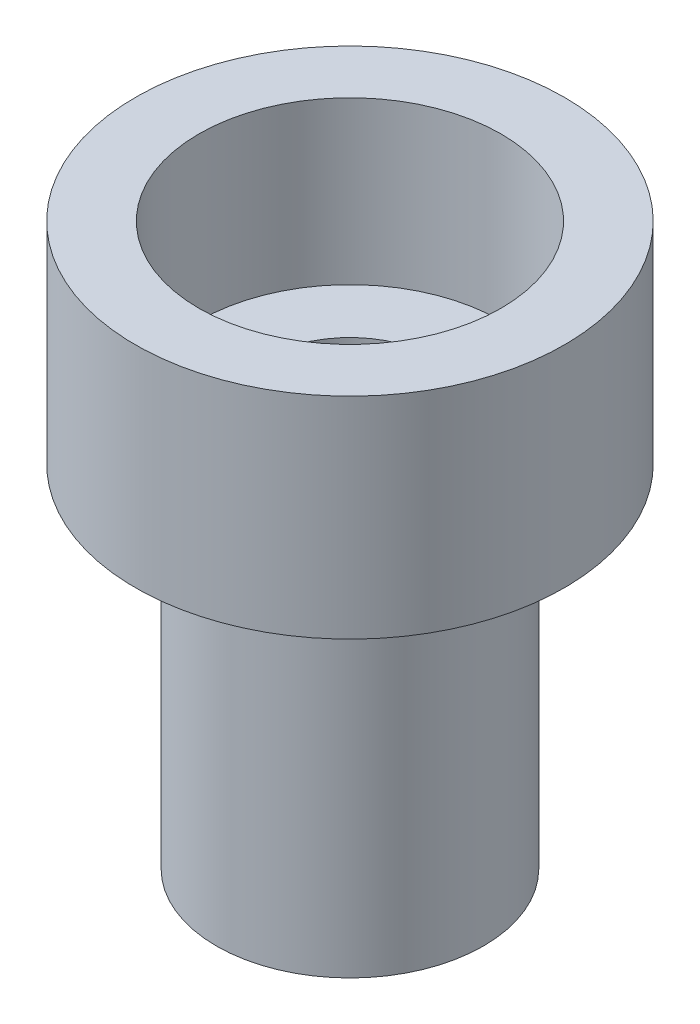
ISO-10303-21;
HEADER;
FILE_DESCRIPTION(('STEP AP214'),'2;1');
FILE_NAME('part.step','',(''),(''),'','','');
FILE_SCHEMA(('AUTOMOTIVE_DESIGN { 1 0 10303 214 1 1 1 1 }'));
ENDSEC;
DATA;
#1=APPLICATION_CONTEXT('core data for automotive mechanical design processes');
#2=APPLICATION_PROTOCOL_DEFINITION('international standard','automotive_design',2000,#1);
#3=PRODUCT_CONTEXT('',#1,'mechanical');
#4=PRODUCT('Part','Part','',(#3));
#5=PRODUCT_RELATED_PRODUCT_CATEGORY('part','',(#4));
#6=PRODUCT_DEFINITION_FORMATION('','',#4);
#7=PRODUCT_DEFINITION_CONTEXT('part definition',#1,'design');
#8=PRODUCT_DEFINITION('design','',#6,#7);
#9=PRODUCT_DEFINITION_SHAPE('','',#8);
#10=(LENGTH_UNIT() NAMED_UNIT(*) SI_UNIT(.MILLI.,.METRE.));
#11=(NAMED_UNIT(*) PLANE_ANGLE_UNIT() SI_UNIT($,.RADIAN.));
#12=(NAMED_UNIT(*) SI_UNIT($,.STERADIAN.) SOLID_ANGLE_UNIT());
#13=UNCERTAINTY_MEASURE_WITH_UNIT(LENGTH_MEASURE(1.E-05),#10,'distance_accuracy_value','');
#14=(GEOMETRIC_REPRESENTATION_CONTEXT(3) GLOBAL_UNCERTAINTY_ASSIGNED_CONTEXT((#13)) GLOBAL_UNIT_ASSIGNED_CONTEXT((#10,
#11,#12)) REPRESENTATION_CONTEXT('',''));
#15=CARTESIAN_POINT('',(0.,0.,0.));
#16=DIRECTION('',(0.,0.,1.));
#17=DIRECTION('',(1.,0.,0.));
#18=AXIS2_PLACEMENT_3D('',#15,#16,#17);
#19=CARTESIAN_POINT('',(3.975,10.4,0.));
#20=DIRECTION('',(0.,1.,0.));
#21=DIRECTION('',(0.,0.,1.));
#22=AXIS2_PLACEMENT_3D('',#19,#20,#21);
#23=PLANE('',#22);
#24=CARTESIAN_POINT('',(0.,10.4,0.));
#25=DIRECTION('',(0.,-1.,0.));
#26=DIRECTION('',(0.,0.,-1.));
#27=AXIS2_PLACEMENT_3D('',#24,#25,#26);
#28=CIRCLE('',#27,2.8);
#29=CARTESIAN_POINT('',(0.,10.4,-2.8));
#30=VERTEX_POINT('',#29);
#31=EDGE_CURVE('E10',#30,#30,#28,.T.);
#32=ORIENTED_EDGE('',*,*,#31,.T.);
#33=EDGE_LOOP('',(#32));
#34=FACE_BOUND('',#33,.T.);
#35=CARTESIAN_POINT('',(0.,10.4,0.));
#36=DIRECTION('',(0.,-1.,0.));
#37=DIRECTION('',(0.,0.,-1.));
#38=AXIS2_PLACEMENT_3D('',#35,#36,#37);
#39=CIRCLE('',#38,3.975);
#40=CARTESIAN_POINT('',(0.,10.4,-3.975));
#41=VERTEX_POINT('',#40);
#42=EDGE_CURVE('E58',#41,#41,#39,.T.);
#43=ORIENTED_EDGE('',*,*,#42,.F.);
#44=EDGE_LOOP('',(#43));
#45=FACE_BOUND('',#44,.T.);
#46=ADVANCED_FACE('F30',(#34,#45),#23,.T.);
#47=CARTESIAN_POINT('',(0.,0.,0.));
#48=DIRECTION('',(0.,-1.,0.));
#49=DIRECTION('',(0.,0.,-1.));
#50=AXIS2_PLACEMENT_3D('',#47,#48,#49);
#51=CYLINDRICAL_SURFACE('',#50,2.8);
#52=CARTESIAN_POINT('',(0.,7.4,0.));
#53=DIRECTION('',(0.,-1.,0.));
#54=DIRECTION('',(0.,0.,-1.));
#55=AXIS2_PLACEMENT_3D('',#52,#53,#54);
#56=CIRCLE('',#55,2.8);
#57=CARTESIAN_POINT('',(0.,7.4,-2.8));
#58=VERTEX_POINT('',#57);
#59=EDGE_CURVE('E36',#58,#58,#56,.T.);
#60=ORIENTED_EDGE('',*,*,#59,.T.);
#61=EDGE_LOOP('',(#60));
#62=FACE_BOUND('',#61,.T.);
#63=ORIENTED_EDGE('',*,*,#31,.F.);
#64=EDGE_LOOP('',(#63));
#65=FACE_BOUND('',#64,.T.);
#66=ADVANCED_FACE('F66',(#62,#65),#51,.F.);
#67=CARTESIAN_POINT('',(2.8,7.4,0.));
#68=DIRECTION('',(0.,1.,0.));
#69=DIRECTION('',(0.,0.,1.));
#70=AXIS2_PLACEMENT_3D('',#67,#68,#69);
#71=PLANE('',#70);
#72=CARTESIAN_POINT('',(0.,7.4,0.));
#73=DIRECTION('',(0.,-1.,0.));
#74=DIRECTION('',(0.,0.,-1.));
#75=AXIS2_PLACEMENT_3D('',#72,#73,#74);
#76=CIRCLE('',#75,1.6);
#77=CARTESIAN_POINT('',(0.,7.4,-1.6));
#78=VERTEX_POINT('',#77);
#79=EDGE_CURVE('E40',#78,#78,#76,.T.);
#80=ORIENTED_EDGE('',*,*,#79,.T.);
#81=EDGE_LOOP('',(#80));
#82=FACE_BOUND('',#81,.T.);
#83=ORIENTED_EDGE('',*,*,#59,.F.);
#84=EDGE_LOOP('',(#83));
#85=FACE_BOUND('',#84,.T.);
#86=ADVANCED_FACE('F70',(#82,#85),#71,.T.);
#87=CARTESIAN_POINT('',(0.,0.,0.));
#88=DIRECTION('',(0.,-1.,0.));
#89=DIRECTION('',(0.,0.,-1.));
#90=AXIS2_PLACEMENT_3D('',#87,#88,#89);
#91=CYLINDRICAL_SURFACE('',#90,1.6);
#92=CARTESIAN_POINT('',(0.,0.,0.));
#93=DIRECTION('',(0.,-1.,0.));
#94=DIRECTION('',(0.,0.,-1.));
#95=AXIS2_PLACEMENT_3D('',#92,#93,#94);
#96=CIRCLE('',#95,1.6);
#97=CARTESIAN_POINT('',(0.,0.,-1.6));
#98=VERTEX_POINT('',#97);
#99=EDGE_CURVE('E44',#98,#98,#96,.T.);
#100=ORIENTED_EDGE('',*,*,#99,.T.);
#101=EDGE_LOOP('',(#100));
#102=FACE_BOUND('',#101,.T.);
#103=ORIENTED_EDGE('',*,*,#79,.F.);
#104=EDGE_LOOP('',(#103));
#105=FACE_BOUND('',#104,.T.);
#106=ADVANCED_FACE('F74',(#102,#105),#91,.F.);
#107=CARTESIAN_POINT('',(1.6,0.,0.));
#108=DIRECTION('',(0.,-1.,0.));
#109=DIRECTION('',(0.,0.,-1.));
#110=AXIS2_PLACEMENT_3D('',#107,#108,#109);
#111=PLANE('',#110);
#112=CARTESIAN_POINT('',(0.,0.,0.));
#113=DIRECTION('',(0.,-1.,0.));
#114=DIRECTION('',(0.,0.,-1.));
#115=AXIS2_PLACEMENT_3D('',#112,#113,#114);
#116=CIRCLE('',#115,2.475);
#117=CARTESIAN_POINT('',(0.,0.,-2.475));
#118=VERTEX_POINT('',#117);
#119=EDGE_CURVE('E49',#118,#118,#116,.T.);
#120=ORIENTED_EDGE('',*,*,#119,.T.);
#121=EDGE_LOOP('',(#120));
#122=FACE_BOUND('',#121,.T.);
#123=ORIENTED_EDGE('',*,*,#99,.F.);
#124=EDGE_LOOP('',(#123));
#125=FACE_BOUND('',#124,.T.);
#126=ADVANCED_FACE('F81',(#122,#125),#111,.T.);
#127=CARTESIAN_POINT('',(0.,0.,0.));
#128=DIRECTION('',(0.,-1.,0.));
#129=DIRECTION('',(0.,0.,-1.));
#130=AXIS2_PLACEMENT_3D('',#127,#128,#129);
#131=CYLINDRICAL_SURFACE('',#130,2.475);
#132=CARTESIAN_POINT('',(0.,6.5,0.));
#133=DIRECTION('',(0.,-1.,0.));
#134=DIRECTION('',(0.,0.,-1.));
#135=AXIS2_PLACEMENT_3D('',#132,#133,#134);
#136=CIRCLE('',#135,2.475);
#137=CARTESIAN_POINT('',(0.,6.5,-2.475));
#138=VERTEX_POINT('',#137);
#139=EDGE_CURVE('E52',#138,#138,#136,.T.);
#140=ORIENTED_EDGE('',*,*,#139,.T.);
#141=EDGE_LOOP('',(#140));
#142=FACE_BOUND('',#141,.T.);
#143=ORIENTED_EDGE('',*,*,#119,.F.);
#144=EDGE_LOOP('',(#143));
#145=FACE_BOUND('',#144,.T.);
#146=ADVANCED_FACE('F85',(#142,#145),#131,.T.);
#147=CARTESIAN_POINT('',(2.475,6.5,0.));
#148=DIRECTION('',(0.,-1.,0.));
#149=DIRECTION('',(0.,0.,-1.));
#150=AXIS2_PLACEMENT_3D('',#147,#148,#149);
#151=PLANE('',#150);
#152=CARTESIAN_POINT('',(0.,6.5,0.));
#153=DIRECTION('',(0.,-1.,0.));
#154=DIRECTION('',(0.,0.,-1.));
#155=AXIS2_PLACEMENT_3D('',#152,#153,#154);
#156=CIRCLE('',#155,3.975);
#157=CARTESIAN_POINT('',(0.,6.5,-3.975));
#158=VERTEX_POINT('',#157);
#159=EDGE_CURVE('E55',#158,#158,#156,.T.);
#160=ORIENTED_EDGE('',*,*,#159,.T.);
#161=EDGE_LOOP('',(#160));
#162=FACE_BOUND('',#161,.T.);
#163=ORIENTED_EDGE('',*,*,#139,.F.);
#164=EDGE_LOOP('',(#163));
#165=FACE_BOUND('',#164,.T.);
#166=ADVANCED_FACE('F89',(#162,#165),#151,.T.);
#167=CARTESIAN_POINT('',(0.,0.,0.));
#168=DIRECTION('',(0.,-1.,0.));
#169=DIRECTION('',(0.,0.,-1.));
#170=AXIS2_PLACEMENT_3D('',#167,#168,#169);
#171=CYLINDRICAL_SURFACE('',#170,3.975);
#172=ORIENTED_EDGE('',*,*,#42,.T.);
#173=EDGE_LOOP('',(#172));
#174=FACE_BOUND('',#173,.T.);
#175=ORIENTED_EDGE('',*,*,#159,.F.);
#176=EDGE_LOOP('',(#175));
#177=FACE_BOUND('',#176,.T.);
#178=ADVANCED_FACE('F62',(#174,#177),#171,.T.);
#179=CLOSED_SHELL('',(#46,#66,#86,#106,#126,#146,#166,#178));
#180=MANIFOLD_SOLID_BREP('B2',#179);
#181=ADVANCED_BREP_SHAPE_REPRESENTATION('',(#18,#180),#14);
#182=SHAPE_DEFINITION_REPRESENTATION(#9,#181);
ENDSEC;
END-ISO-10303-21;
